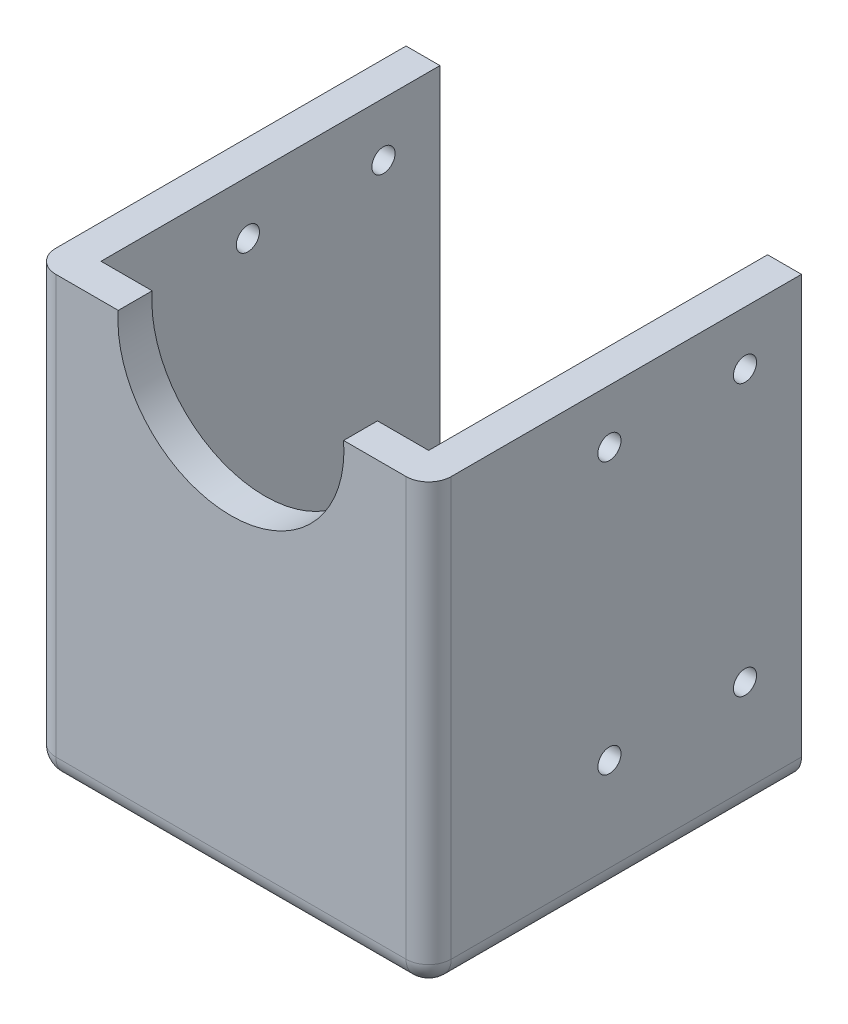
ISO-10303-21;
HEADER;
FILE_DESCRIPTION(('STEP AP214'),'2;1');
FILE_NAME('part.step','',(''),(''),'','','');
FILE_SCHEMA(('AUTOMOTIVE_DESIGN { 1 0 10303 214 1 1 1 1 }'));
ENDSEC;
DATA;
#1=APPLICATION_CONTEXT('core data for automotive mechanical design processes');
#2=APPLICATION_PROTOCOL_DEFINITION('international standard','automotive_design',2000,#1);
#3=PRODUCT_CONTEXT('',#1,'mechanical');
#4=PRODUCT('Part','Part','',(#3));
#5=PRODUCT_RELATED_PRODUCT_CATEGORY('part','',(#4));
#6=PRODUCT_DEFINITION_FORMATION('','',#4);
#7=PRODUCT_DEFINITION_CONTEXT('part definition',#1,'design');
#8=PRODUCT_DEFINITION('design','',#6,#7);
#9=PRODUCT_DEFINITION_SHAPE('','',#8);
#10=(LENGTH_UNIT() NAMED_UNIT(*) SI_UNIT(.MILLI.,.METRE.));
#11=(NAMED_UNIT(*) PLANE_ANGLE_UNIT() SI_UNIT($,.RADIAN.));
#12=(NAMED_UNIT(*) SI_UNIT($,.STERADIAN.) SOLID_ANGLE_UNIT());
#13=UNCERTAINTY_MEASURE_WITH_UNIT(LENGTH_MEASURE(1.E-05),#10,'distance_accuracy_value','');
#14=(GEOMETRIC_REPRESENTATION_CONTEXT(3) GLOBAL_UNCERTAINTY_ASSIGNED_CONTEXT((#13)) GLOBAL_UNIT_ASSIGNED_CONTEXT((#10,
#11,#12)) REPRESENTATION_CONTEXT('',''));
#15=CARTESIAN_POINT('',(0.,0.,0.));
#16=DIRECTION('',(0.,0.,1.));
#17=DIRECTION('',(1.,0.,0.));
#18=AXIS2_PLACEMENT_3D('',#15,#16,#17);
#19=CARTESIAN_POINT('',(0.,0.750000000000668,3.));
#20=DIRECTION('',(0.,-1.,0.));
#21=DIRECTION('',(1.,0.,0.));
#22=AXIS2_PLACEMENT_3D('',#19,#20,#21);
#23=PLANE('',#22);
#24=DIRECTION('',(0.,0.,-1.));
#25=VECTOR('',#24,1.);
#26=CARTESIAN_POINT('',(-17.2499999999993,0.750000000000666,3.));
#27=LINE('',#26,#25);
#28=CARTESIAN_POINT('',(-17.2499999999993,0.750000000000666,1.));
#29=VERTEX_POINT('',#28);
#30=CARTESIAN_POINT('',(-17.2499999999993,0.750000000000666,-30.));
#31=VERTEX_POINT('',#30);
#32=EDGE_CURVE('E213',#29,#31,#27,.T.);
#33=ORIENTED_EDGE('',*,*,#32,.F.);
#34=CARTESIAN_POINT('',(-15.2499999999993,0.750000000000667,1.));
#35=DIRECTION('',(0.,-1.,0.));
#36=DIRECTION('',(1.,0.,0.));
#37=AXIS2_PLACEMENT_3D('',#34,#35,#36);
#38=CIRCLE('',#37,2.);
#39=CARTESIAN_POINT('',(-15.2499999999993,0.750000000000667,3.));
#40=VERTEX_POINT('',#39);
#41=EDGE_CURVE('E216',#29,#40,#38,.F.);
#42=ORIENTED_EDGE('',*,*,#41,.T.);
#43=DIRECTION('',(-1.,0.,0.));
#44=VECTOR('',#43,1.);
#45=CARTESIAN_POINT('',(0.,0.750000000000668,3.));
#46=LINE('',#45,#44);
#47=CARTESIAN_POINT('',(-9.72183533758884,0.750000000000667,3.));
#48=VERTEX_POINT('',#47);
#49=EDGE_CURVE('E333',#48,#40,#46,.T.);
#50=ORIENTED_EDGE('',*,*,#49,.F.);
#51=DIRECTION('',(0.,0.,-1.));
#52=VECTOR('',#51,1.);
#53=CARTESIAN_POINT('',(-9.72183533758884,0.750000000000667,3.));
#54=LINE('',#53,#52);
#55=CARTESIAN_POINT('',(-9.72183533758884,0.750000000000667,0.));
#56=VERTEX_POINT('',#55);
#57=EDGE_CURVE('E351',#48,#56,#54,.T.);
#58=ORIENTED_EDGE('',*,*,#57,.T.);
#59=DIRECTION('',(-1.,0.,0.));
#60=VECTOR('',#59,1.);
#61=CARTESIAN_POINT('',(0.,0.750000000000668,0.));
#62=LINE('',#61,#60);
#63=CARTESIAN_POINT('',(-14.2499999999993,0.750000000000667,0.));
#64=VERTEX_POINT('',#63);
#65=EDGE_CURVE('E141',#56,#64,#62,.T.);
#66=ORIENTED_EDGE('',*,*,#65,.T.);
#67=DIRECTION('',(0.,0.,1.));
#68=VECTOR('',#67,1.);
#69=CARTESIAN_POINT('',(-14.2499999999993,0.750000000000667,-30.));
#70=LINE('',#69,#68);
#71=CARTESIAN_POINT('',(-14.2499999999993,0.750000000000667,-30.));
#72=VERTEX_POINT('',#71);
#73=EDGE_CURVE('E136',#72,#64,#70,.T.);
#74=ORIENTED_EDGE('',*,*,#73,.F.);
#75=DIRECTION('',(-1.,0.,0.));
#76=VECTOR('',#75,1.);
#77=CARTESIAN_POINT('',(0.,0.750000000000668,-30.));
#78=LINE('',#77,#76);
#79=EDGE_CURVE('E139',#72,#31,#78,.T.);
#80=ORIENTED_EDGE('',*,*,#79,.T.);
#81=EDGE_LOOP('',(#33,#42,#50,#58,#66,#74,#80));
#82=FACE_BOUND('',#81,.T.);
#83=ADVANCED_FACE('F34',(#82),#23,.F.);
#84=CARTESIAN_POINT('',(-17.2499999999993,0.,3.));
#85=DIRECTION('',(-1.,0.,0.));
#86=DIRECTION('',(0.,0.,1.));
#87=AXIS2_PLACEMENT_3D('',#84,#85,#86);
#88=PLANE('',#87);
#89=CARTESIAN_POINT('',(-17.2499999999993,-27.9999999999993,-13.));
#90=DIRECTION('',(-1.,0.,0.));
#91=DIRECTION('',(0.,0.,1.));
#92=AXIS2_PLACEMENT_3D('',#89,#90,#91);
#93=CIRCLE('',#92,1.025);
#94=CARTESIAN_POINT('',(-17.2499999999993,-27.9999999999993,-11.975));
#95=VERTEX_POINT('',#94);
#96=EDGE_CURVE('E285',#95,#95,#93,.T.);
#97=ORIENTED_EDGE('',*,*,#96,.F.);
#98=EDGE_LOOP('',(#97));
#99=FACE_BOUND('',#98,.T.);
#100=CARTESIAN_POINT('',(-17.2499999999993,-27.9999999999993,-25.));
#101=DIRECTION('',(-1.,0.,0.));
#102=DIRECTION('',(0.,0.,1.));
#103=AXIS2_PLACEMENT_3D('',#100,#101,#102);
#104=CIRCLE('',#103,1.025);
#105=CARTESIAN_POINT('',(-17.2499999999993,-27.9999999999993,-23.975));
#106=VERTEX_POINT('',#105);
#107=EDGE_CURVE('E292',#106,#106,#104,.T.);
#108=ORIENTED_EDGE('',*,*,#107,.F.);
#109=EDGE_LOOP('',(#108));
#110=FACE_BOUND('',#109,.T.);
#111=CARTESIAN_POINT('',(-17.2499999999993,-3.99999999999933,-13.));
#112=DIRECTION('',(-1.,0.,0.));
#113=DIRECTION('',(0.,0.,1.));
#114=AXIS2_PLACEMENT_3D('',#111,#112,#113);
#115=CIRCLE('',#114,1.025);
#116=CARTESIAN_POINT('',(-17.2499999999993,-3.99999999999933,-11.975));
#117=VERTEX_POINT('',#116);
#118=EDGE_CURVE('E299',#117,#117,#115,.T.);
#119=ORIENTED_EDGE('',*,*,#118,.F.);
#120=EDGE_LOOP('',(#119));
#121=FACE_BOUND('',#120,.T.);
#122=CARTESIAN_POINT('',(-17.2499999999993,-3.99999999999933,-25.));
#123=DIRECTION('',(-1.,0.,0.));
#124=DIRECTION('',(0.,0.,1.));
#125=AXIS2_PLACEMENT_3D('',#122,#123,#124);
#126=CIRCLE('',#125,1.025);
#127=CARTESIAN_POINT('',(-17.2499999999993,-3.99999999999933,-23.975));
#128=VERTEX_POINT('',#127);
#129=EDGE_CURVE('E168',#128,#128,#126,.T.);
#130=ORIENTED_EDGE('',*,*,#129,.F.);
#131=EDGE_LOOP('',(#130));
#132=FACE_BOUND('',#131,.T.);
#133=DIRECTION('',(0.,0.,-1.));
#134=VECTOR('',#133,1.);
#135=CARTESIAN_POINT('',(-17.2499999999993,-36.2499999999993,3.));
#136=LINE('',#135,#134);
#137=CARTESIAN_POINT('',(-17.2499999999993,-36.2499999999993,-30.));
#138=VERTEX_POINT('',#137);
#139=CARTESIAN_POINT('',(-17.2499999999993,-36.2499999999993,1.));
#140=VERTEX_POINT('',#139);
#141=EDGE_CURVE('E210',#138,#140,#136,.F.);
#142=ORIENTED_EDGE('',*,*,#141,.T.);
#143=DIRECTION('',(0.,1.,0.));
#144=VECTOR('',#143,1.);
#145=CARTESIAN_POINT('',(-17.2499999999993,0.,1.));
#146=LINE('',#145,#144);
#147=EDGE_CURVE('E212',#140,#29,#146,.T.);
#148=ORIENTED_EDGE('',*,*,#147,.T.);
#149=ORIENTED_EDGE('',*,*,#32,.T.);
#150=DIRECTION('',(0.,1.,0.));
#151=VECTOR('',#150,1.);
#152=CARTESIAN_POINT('',(-17.2499999999993,0.,-30.));
#153=LINE('',#152,#151);
#154=EDGE_CURVE('E156',#138,#31,#153,.T.);
#155=ORIENTED_EDGE('',*,*,#154,.F.);
#156=EDGE_LOOP('',(#142,#148,#149,#155));
#157=FACE_BOUND('',#156,.T.);
#158=ADVANCED_FACE('F311',(#99,#110,#121,#132,#157),#88,.T.);
#159=CARTESIAN_POINT('',(0.,-38.2499999999993,3.));
#160=DIRECTION('',(0.,-1.,0.));
#161=DIRECTION('',(1.,0.,0.));
#162=AXIS2_PLACEMENT_3D('',#159,#160,#161);
#163=PLANE('',#162);
#164=CARTESIAN_POINT('',(8.25000000000068,-38.2499999999993,-13.));
#165=DIRECTION('',(0.,-1.,0.));
#166=DIRECTION('',(1.,0.,0.));
#167=AXIS2_PLACEMENT_3D('',#164,#165,#166);
#168=CIRCLE('',#167,1.025);
#169=CARTESIAN_POINT('',(9.27500000000068,-38.2499999999993,-13.));
#170=VERTEX_POINT('',#169);
#171=EDGE_CURVE('E253',#170,#170,#168,.T.);
#172=ORIENTED_EDGE('',*,*,#171,.F.);
#173=EDGE_LOOP('',(#172));
#174=FACE_BOUND('',#173,.T.);
#175=CARTESIAN_POINT('',(-7.74999999999932,-38.2499999999993,-13.));
#176=DIRECTION('',(0.,-1.,0.));
#177=DIRECTION('',(1.,0.,0.));
#178=AXIS2_PLACEMENT_3D('',#175,#176,#177);
#179=CIRCLE('',#178,1.025);
#180=CARTESIAN_POINT('',(-6.72499999999932,-38.2499999999993,-13.));
#181=VERTEX_POINT('',#180);
#182=EDGE_CURVE('E261',#181,#181,#179,.T.);
#183=ORIENTED_EDGE('',*,*,#182,.F.);
#184=EDGE_LOOP('',(#183));
#185=FACE_BOUND('',#184,.T.);
#186=CARTESIAN_POINT('',(-7.74999999999932,-38.2499999999993,-25.));
#187=DIRECTION('',(0.,-1.,0.));
#188=DIRECTION('',(1.,0.,0.));
#189=AXIS2_PLACEMENT_3D('',#186,#187,#188);
#190=CIRCLE('',#189,1.025);
#191=CARTESIAN_POINT('',(-6.72499999999932,-38.2499999999993,-25.));
#192=VERTEX_POINT('',#191);
#193=EDGE_CURVE('E267',#192,#192,#190,.T.);
#194=ORIENTED_EDGE('',*,*,#193,.F.);
#195=EDGE_LOOP('',(#194));
#196=FACE_BOUND('',#195,.T.);
#197=CARTESIAN_POINT('',(8.25000000000068,-38.2499999999993,-25.));
#198=DIRECTION('',(0.,-1.,0.));
#199=DIRECTION('',(1.,0.,0.));
#200=AXIS2_PLACEMENT_3D('',#197,#198,#199);
#201=CIRCLE('',#200,1.025);
#202=CARTESIAN_POINT('',(9.27500000000068,-38.2499999999993,-25.));
#203=VERTEX_POINT('',#202);
#204=EDGE_CURVE('E273',#203,#203,#201,.T.);
#205=ORIENTED_EDGE('',*,*,#204,.F.);
#206=EDGE_LOOP('',(#205));
#207=FACE_BOUND('',#206,.T.);
#208=DIRECTION('',(-1.,0.,0.));
#209=VECTOR('',#208,1.);
#210=CARTESIAN_POINT('',(0.,-38.2499999999993,1.));
#211=LINE('',#210,#209);
#212=CARTESIAN_POINT('',(15.7500000000007,-38.2499999999993,1.));
#213=VERTEX_POINT('',#212);
#214=CARTESIAN_POINT('',(-15.2499999999993,-38.2499999999993,1.));
#215=VERTEX_POINT('',#214);
#216=EDGE_CURVE('E224',#213,#215,#211,.T.);
#217=ORIENTED_EDGE('',*,*,#216,.T.);
#218=DIRECTION('',(0.,0.,-1.));
#219=VECTOR('',#218,1.);
#220=CARTESIAN_POINT('',(-15.2499999999993,-38.2499999999993,3.));
#221=LINE('',#220,#219);
#222=CARTESIAN_POINT('',(-15.2499999999993,-38.2499999999993,-30.));
#223=VERTEX_POINT('',#222);
#224=EDGE_CURVE('E228',#215,#223,#221,.T.);
#225=ORIENTED_EDGE('',*,*,#224,.T.);
#226=DIRECTION('',(-1.,0.,0.));
#227=VECTOR('',#226,1.);
#228=CARTESIAN_POINT('',(0.,-38.2499999999993,-30.));
#229=LINE('',#228,#227);
#230=CARTESIAN_POINT('',(15.7500000000007,-38.2499999999993,-30.));
#231=VERTEX_POINT('',#230);
#232=EDGE_CURVE('E172',#231,#223,#229,.T.);
#233=ORIENTED_EDGE('',*,*,#232,.F.);
#234=DIRECTION('',(0.,0.,-1.));
#235=VECTOR('',#234,1.);
#236=CARTESIAN_POINT('',(15.7500000000007,-38.2499999999993,3.));
#237=LINE('',#236,#235);
#238=EDGE_CURVE('E226',#231,#213,#237,.F.);
#239=ORIENTED_EDGE('',*,*,#238,.T.);
#240=EDGE_LOOP('',(#217,#225,#233,#239));
#241=FACE_BOUND('',#240,.T.);
#242=ADVANCED_FACE('F314',(#174,#185,#196,#207,#241),#163,.T.);
#243=CARTESIAN_POINT('',(17.7500000000007,0.,3.));
#244=DIRECTION('',(-1.,0.,0.));
#245=DIRECTION('',(0.,0.,1.));
#246=AXIS2_PLACEMENT_3D('',#243,#244,#245);
#247=PLANE('',#246);
#248=CARTESIAN_POINT('',(17.7500000000007,-27.9999999999993,-13.));
#249=DIRECTION('',(1.,0.,0.));
#250=DIRECTION('',(0.,0.,-1.));
#251=AXIS2_PLACEMENT_3D('',#248,#249,#250);
#252=CIRCLE('',#251,1.025);
#253=CARTESIAN_POINT('',(17.7500000000007,-27.9999999999993,-14.025));
#254=VERTEX_POINT('',#253);
#255=EDGE_CURVE('E209',#254,#254,#252,.T.);
#256=ORIENTED_EDGE('',*,*,#255,.F.);
#257=EDGE_LOOP('',(#256));
#258=FACE_BOUND('',#257,.T.);
#259=CARTESIAN_POINT('',(17.7500000000007,-27.9999999999993,-25.));
#260=DIRECTION('',(1.,0.,0.));
#261=DIRECTION('',(0.,0.,-1.));
#262=AXIS2_PLACEMENT_3D('',#259,#260,#261);
#263=CIRCLE('',#262,1.025);
#264=CARTESIAN_POINT('',(17.7500000000007,-27.9999999999993,-26.025));
#265=VERTEX_POINT('',#264);
#266=EDGE_CURVE('E204',#265,#265,#263,.T.);
#267=ORIENTED_EDGE('',*,*,#266,.F.);
#268=EDGE_LOOP('',(#267));
#269=FACE_BOUND('',#268,.T.);
#270=CARTESIAN_POINT('',(17.7500000000007,-3.99999999999933,-13.));
#271=DIRECTION('',(1.,0.,0.));
#272=DIRECTION('',(0.,0.,-1.));
#273=AXIS2_PLACEMENT_3D('',#270,#271,#272);
#274=CIRCLE('',#273,1.025);
#275=CARTESIAN_POINT('',(17.7500000000007,-3.99999999999933,-14.025));
#276=VERTEX_POINT('',#275);
#277=EDGE_CURVE('E199',#276,#276,#274,.T.);
#278=ORIENTED_EDGE('',*,*,#277,.F.);
#279=EDGE_LOOP('',(#278));
#280=FACE_BOUND('',#279,.T.);
#281=CARTESIAN_POINT('',(17.7500000000007,-3.99999999999933,-25.));
#282=DIRECTION('',(1.,0.,0.));
#283=DIRECTION('',(0.,0.,-1.));
#284=AXIS2_PLACEMENT_3D('',#281,#282,#283);
#285=CIRCLE('',#284,1.025);
#286=CARTESIAN_POINT('',(17.7500000000007,-3.99999999999933,-26.025));
#287=VERTEX_POINT('',#286);
#288=EDGE_CURVE('E194',#287,#287,#285,.T.);
#289=ORIENTED_EDGE('',*,*,#288,.F.);
#290=EDGE_LOOP('',(#289));
#291=FACE_BOUND('',#290,.T.);
#292=DIRECTION('',(0.,1.,0.));
#293=VECTOR('',#292,1.);
#294=CARTESIAN_POINT('',(17.7500000000007,-38.2499999999993,1.));
#295=LINE('',#294,#293);
#296=CARTESIAN_POINT('',(17.7500000000007,0.75000000000067,1.));
#297=VERTEX_POINT('',#296);
#298=CARTESIAN_POINT('',(17.7500000000007,-36.2499999999993,1.));
#299=VERTEX_POINT('',#298);
#300=EDGE_CURVE('E51',#297,#299,#295,.F.);
#301=ORIENTED_EDGE('',*,*,#300,.T.);
#302=DIRECTION('',(0.,0.,-1.));
#303=VECTOR('',#302,1.);
#304=CARTESIAN_POINT('',(17.7500000000007,-36.2499999999993,-30.));
#305=LINE('',#304,#303);
#306=CARTESIAN_POINT('',(17.7500000000007,-36.2499999999993,-30.));
#307=VERTEX_POINT('',#306);
#308=EDGE_CURVE('E43',#299,#307,#305,.T.);
#309=ORIENTED_EDGE('',*,*,#308,.T.);
#310=DIRECTION('',(0.,1.,0.));
#311=VECTOR('',#310,1.);
#312=CARTESIAN_POINT('',(17.7500000000007,0.,-30.));
#313=LINE('',#312,#311);
#314=CARTESIAN_POINT('',(17.7500000000007,0.75000000000067,-30.));
#315=VERTEX_POINT('',#314);
#316=EDGE_CURVE('E174',#307,#315,#313,.T.);
#317=ORIENTED_EDGE('',*,*,#316,.T.);
#318=DIRECTION('',(0.,0.,-1.));
#319=VECTOR('',#318,1.);
#320=CARTESIAN_POINT('',(17.7500000000007,0.75000000000067,3.));
#321=LINE('',#320,#319);
#322=EDGE_CURVE('E379',#297,#315,#321,.T.);
#323=ORIENTED_EDGE('',*,*,#322,.F.);
#324=EDGE_LOOP('',(#301,#309,#317,#323));
#325=FACE_BOUND('',#324,.T.);
#326=ADVANCED_FACE('F595',(#258,#269,#280,#291,#325),#247,.F.);
#327=CARTESIAN_POINT('',(0.,0.750000000000668,3.));
#328=DIRECTION('',(0.,-1.,0.));
#329=DIRECTION('',(1.,0.,0.));
#330=AXIS2_PLACEMENT_3D('',#327,#328,#329);
#331=PLANE('',#330);
#332=DIRECTION('',(-1.,0.,0.));
#333=VECTOR('',#332,1.);
#334=CARTESIAN_POINT('',(0.,0.750000000000668,3.));
#335=LINE('',#334,#333);
#336=CARTESIAN_POINT('',(15.7500000000007,0.750000000000671,3.));
#337=VERTEX_POINT('',#336);
#338=CARTESIAN_POINT('',(10.2218353375902,0.75000000000067,3.));
#339=VERTEX_POINT('',#338);
#340=EDGE_CURVE('E340',#337,#339,#335,.T.);
#341=ORIENTED_EDGE('',*,*,#340,.F.);
#342=CARTESIAN_POINT('',(15.7500000000007,0.750000000000671,1.));
#343=DIRECTION('',(0.,-1.,0.));
#344=DIRECTION('',(1.,0.,0.));
#345=AXIS2_PLACEMENT_3D('',#342,#343,#344);
#346=CIRCLE('',#345,2.);
#347=EDGE_CURVE('E11',#337,#297,#346,.F.);
#348=ORIENTED_EDGE('',*,*,#347,.T.);
#349=ORIENTED_EDGE('',*,*,#322,.T.);
#350=DIRECTION('',(1.,0.,0.));
#351=VECTOR('',#350,1.);
#352=CARTESIAN_POINT('',(0.,0.750000000000672,-30.));
#353=LINE('',#352,#351);
#354=CARTESIAN_POINT('',(14.7500000000007,0.75000000000067,-30.));
#355=VERTEX_POINT('',#354);
#356=EDGE_CURVE('E177',#355,#315,#353,.T.);
#357=ORIENTED_EDGE('',*,*,#356,.F.);
#358=DIRECTION('',(0.,0.,1.));
#359=VECTOR('',#358,1.);
#360=CARTESIAN_POINT('',(14.7500000000007,0.75000000000067,-30.));
#361=LINE('',#360,#359);
#362=CARTESIAN_POINT('',(14.7500000000007,0.75000000000067,0.));
#363=VERTEX_POINT('',#362);
#364=EDGE_CURVE('E145',#355,#363,#361,.T.);
#365=ORIENTED_EDGE('',*,*,#364,.T.);
#366=DIRECTION('',(-1.,0.,0.));
#367=VECTOR('',#366,1.);
#368=CARTESIAN_POINT('',(0.,0.750000000000668,0.));
#369=LINE('',#368,#367);
#370=CARTESIAN_POINT('',(10.2218353375902,0.75000000000067,0.));
#371=VERTEX_POINT('',#370);
#372=EDGE_CURVE('E345',#363,#371,#369,.T.);
#373=ORIENTED_EDGE('',*,*,#372,.T.);
#374=DIRECTION('',(0.,0.,-1.));
#375=VECTOR('',#374,1.);
#376=CARTESIAN_POINT('',(10.2218353375902,0.75000000000067,3.));
#377=LINE('',#376,#375);
#378=EDGE_CURVE('E673',#339,#371,#377,.T.);
#379=ORIENTED_EDGE('',*,*,#378,.F.);
#380=EDGE_LOOP('',(#341,#348,#349,#357,#365,#373,#379));
#381=FACE_BOUND('',#380,.T.);
#382=ADVANCED_FACE('F378',(#381),#331,.F.);
#383=CARTESIAN_POINT('',(0.250000000000675,0.,3.));
#384=DIRECTION('',(0.,0.,-1.));
#385=DIRECTION('',(-1.,0.,0.));
#386=AXIS2_PLACEMENT_3D('',#383,#384,#385);
#387=CYLINDRICAL_SURFACE('',#386,10.);
#388=CARTESIAN_POINT('',(0.250000000000675,0.,0.));
#389=DIRECTION('',(0.,0.,1.));
#390=DIRECTION('',(1.,0.,0.));
#391=AXIS2_PLACEMENT_3D('',#388,#389,#390);
#392=CIRCLE('',#391,10.);
#393=EDGE_CURVE('E341',#56,#371,#392,.T.);
#394=ORIENTED_EDGE('',*,*,#393,.F.);
#395=ORIENTED_EDGE('',*,*,#57,.F.);
#396=CARTESIAN_POINT('',(0.250000000000675,0.,3.));
#397=DIRECTION('',(0.,0.,1.));
#398=DIRECTION('',(1.,0.,0.));
#399=AXIS2_PLACEMENT_3D('',#396,#397,#398);
#400=CIRCLE('',#399,10.);
#401=EDGE_CURVE('E339',#48,#339,#400,.T.);
#402=ORIENTED_EDGE('',*,*,#401,.T.);
#403=ORIENTED_EDGE('',*,*,#378,.T.);
#404=EDGE_LOOP('',(#394,#395,#402,#403));
#405=FACE_BOUND('',#404,.T.);
#406=ADVANCED_FACE('F594',(#405),#387,.F.);
#407=CARTESIAN_POINT('',(0.,0.,3.));
#408=DIRECTION('',(0.,0.,1.));
#409=DIRECTION('',(1.,0.,0.));
#410=AXIS2_PLACEMENT_3D('',#407,#408,#409);
#411=PLANE('',#410);
#412=ORIENTED_EDGE('',*,*,#49,.T.);
#413=DIRECTION('',(0.,1.,0.));
#414=VECTOR('',#413,1.);
#415=CARTESIAN_POINT('',(-15.2499999999993,0.,3.));
#416=LINE('',#415,#414);
#417=CARTESIAN_POINT('',(-15.2499999999993,-36.2499999999993,3.));
#418=VERTEX_POINT('',#417);
#419=EDGE_CURVE('E222',#40,#418,#416,.F.);
#420=ORIENTED_EDGE('',*,*,#419,.T.);
#421=DIRECTION('',(-1.,0.,0.));
#422=VECTOR('',#421,1.);
#423=CARTESIAN_POINT('',(0.,-36.2499999999993,3.));
#424=LINE('',#423,#422);
#425=CARTESIAN_POINT('',(15.7500000000007,-36.2499999999993,3.));
#426=VERTEX_POINT('',#425);
#427=EDGE_CURVE('E220',#418,#426,#424,.F.);
#428=ORIENTED_EDGE('',*,*,#427,.T.);
#429=DIRECTION('',(0.,1.,0.));
#430=VECTOR('',#429,1.);
#431=CARTESIAN_POINT('',(15.7500000000007,0.75000000000067,3.));
#432=LINE('',#431,#430);
#433=EDGE_CURVE('E218',#426,#337,#432,.T.);
#434=ORIENTED_EDGE('',*,*,#433,.T.);
#435=ORIENTED_EDGE('',*,*,#340,.T.);
#436=ORIENTED_EDGE('',*,*,#401,.F.);
#437=EDGE_LOOP('',(#412,#420,#428,#434,#435,#436));
#438=FACE_BOUND('',#437,.T.);
#439=ADVANCED_FACE('F336',(#438),#411,.T.);
#440=CARTESIAN_POINT('',(0.,0.,0.));
#441=DIRECTION('',(0.,0.,1.));
#442=DIRECTION('',(1.,0.,0.));
#443=AXIS2_PLACEMENT_3D('',#440,#441,#442);
#444=PLANE('',#443);
#445=DIRECTION('',(-1.,0.,0.));
#446=VECTOR('',#445,1.);
#447=CARTESIAN_POINT('',(0.,-35.2499999999993,0.));
#448=LINE('',#447,#446);
#449=CARTESIAN_POINT('',(14.7500000000007,-35.2499999999993,0.));
#450=VERTEX_POINT('',#449);
#451=CARTESIAN_POINT('',(-14.2499999999993,-35.2499999999993,0.));
#452=VERTEX_POINT('',#451);
#453=EDGE_CURVE('E162',#450,#452,#448,.T.);
#454=ORIENTED_EDGE('',*,*,#453,.T.);
#455=DIRECTION('',(0.,1.,0.));
#456=VECTOR('',#455,1.);
#457=CARTESIAN_POINT('',(-14.2499999999993,0.,0.));
#458=LINE('',#457,#456);
#459=EDGE_CURVE('E186',#452,#64,#458,.T.);
#460=ORIENTED_EDGE('',*,*,#459,.T.);
#461=ORIENTED_EDGE('',*,*,#65,.F.);
#462=ORIENTED_EDGE('',*,*,#393,.T.);
#463=ORIENTED_EDGE('',*,*,#372,.F.);
#464=DIRECTION('',(0.,1.,0.));
#465=VECTOR('',#464,1.);
#466=CARTESIAN_POINT('',(14.7500000000007,0.,0.));
#467=LINE('',#466,#465);
#468=EDGE_CURVE('E165',#450,#363,#467,.T.);
#469=ORIENTED_EDGE('',*,*,#468,.F.);
#470=EDGE_LOOP('',(#454,#460,#461,#462,#463,#469));
#471=FACE_BOUND('',#470,.T.);
#472=ADVANCED_FACE('F376',(#471),#444,.F.);
#473=CARTESIAN_POINT('',(-14.2499999999993,0.,-30.));
#474=DIRECTION('',(1.,0.,0.));
#475=DIRECTION('',(0.,0.,-1.));
#476=AXIS2_PLACEMENT_3D('',#473,#474,#475);
#477=PLANE('',#476);
#478=CARTESIAN_POINT('',(-14.2499999999993,-27.9999999999993,-13.));
#479=DIRECTION('',(1.,0.,0.));
#480=DIRECTION('',(0.,0.,-1.));
#481=AXIS2_PLACEMENT_3D('',#478,#479,#480);
#482=CIRCLE('',#481,1.025);
#483=CARTESIAN_POINT('',(-14.2499999999993,-27.9999999999993,-14.025));
#484=VERTEX_POINT('',#483);
#485=EDGE_CURVE('E208',#484,#484,#482,.T.);
#486=ORIENTED_EDGE('',*,*,#485,.F.);
#487=EDGE_LOOP('',(#486));
#488=FACE_BOUND('',#487,.T.);
#489=CARTESIAN_POINT('',(-14.2499999999993,-27.9999999999993,-25.));
#490=DIRECTION('',(1.,0.,0.));
#491=DIRECTION('',(0.,0.,-1.));
#492=AXIS2_PLACEMENT_3D('',#489,#490,#491);
#493=CIRCLE('',#492,1.025);
#494=CARTESIAN_POINT('',(-14.2499999999993,-27.9999999999993,-26.025));
#495=VERTEX_POINT('',#494);
#496=EDGE_CURVE('E203',#495,#495,#493,.T.);
#497=ORIENTED_EDGE('',*,*,#496,.F.);
#498=EDGE_LOOP('',(#497));
#499=FACE_BOUND('',#498,.T.);
#500=CARTESIAN_POINT('',(-14.2499999999993,-3.99999999999933,-13.));
#501=DIRECTION('',(1.,0.,0.));
#502=DIRECTION('',(0.,0.,-1.));
#503=AXIS2_PLACEMENT_3D('',#500,#501,#502);
#504=CIRCLE('',#503,1.025);
#505=CARTESIAN_POINT('',(-14.2499999999993,-3.99999999999933,-14.025));
#506=VERTEX_POINT('',#505);
#507=EDGE_CURVE('E198',#506,#506,#504,.T.);
#508=ORIENTED_EDGE('',*,*,#507,.F.);
#509=EDGE_LOOP('',(#508));
#510=FACE_BOUND('',#509,.T.);
#511=CARTESIAN_POINT('',(-14.2499999999993,-3.99999999999933,-25.));
#512=DIRECTION('',(1.,0.,0.));
#513=DIRECTION('',(0.,0.,-1.));
#514=AXIS2_PLACEMENT_3D('',#511,#512,#513);
#515=CIRCLE('',#514,1.025);
#516=CARTESIAN_POINT('',(-14.2499999999993,-3.99999999999933,-26.025));
#517=VERTEX_POINT('',#516);
#518=EDGE_CURVE('E193',#517,#517,#515,.T.);
#519=ORIENTED_EDGE('',*,*,#518,.F.);
#520=EDGE_LOOP('',(#519));
#521=FACE_BOUND('',#520,.T.);
#522=ORIENTED_EDGE('',*,*,#459,.F.);
#523=DIRECTION('',(0.,0.,1.));
#524=VECTOR('',#523,1.);
#525=CARTESIAN_POINT('',(-14.2499999999993,-35.2499999999993,-30.));
#526=LINE('',#525,#524);
#527=CARTESIAN_POINT('',(-14.2499999999993,-35.2499999999993,-30.));
#528=VERTEX_POINT('',#527);
#529=EDGE_CURVE('E161',#528,#452,#526,.T.);
#530=ORIENTED_EDGE('',*,*,#529,.F.);
#531=DIRECTION('',(0.,1.,0.));
#532=VECTOR('',#531,1.);
#533=CARTESIAN_POINT('',(-14.2499999999993,0.,-30.));
#534=LINE('',#533,#532);
#535=EDGE_CURVE('E153',#528,#72,#534,.T.);
#536=ORIENTED_EDGE('',*,*,#535,.T.);
#537=ORIENTED_EDGE('',*,*,#73,.T.);
#538=EDGE_LOOP('',(#522,#530,#536,#537));
#539=FACE_BOUND('',#538,.T.);
#540=ADVANCED_FACE('F159',(#488,#499,#510,#521,#539),#477,.T.);
#541=CARTESIAN_POINT('',(0.,-35.2499999999993,-30.));
#542=DIRECTION('',(0.,1.,0.));
#543=DIRECTION('',(-1.,0.,0.));
#544=AXIS2_PLACEMENT_3D('',#541,#542,#543);
#545=PLANE('',#544);
#546=CARTESIAN_POINT('',(8.25000000000068,-35.2499999999993,-13.));
#547=DIRECTION('',(0.,-1.,0.));
#548=DIRECTION('',(1.,0.,0.));
#549=AXIS2_PLACEMENT_3D('',#546,#547,#548);
#550=CIRCLE('',#549,1.025);
#551=CARTESIAN_POINT('',(9.27500000000068,-35.2499999999993,-13.));
#552=VERTEX_POINT('',#551);
#553=EDGE_CURVE('E256',#552,#552,#550,.T.);
#554=ORIENTED_EDGE('',*,*,#553,.T.);
#555=EDGE_LOOP('',(#554));
#556=FACE_BOUND('',#555,.T.);
#557=CARTESIAN_POINT('',(-7.74999999999932,-35.2499999999993,-13.));
#558=DIRECTION('',(0.,-1.,0.));
#559=DIRECTION('',(1.,0.,0.));
#560=AXIS2_PLACEMENT_3D('',#557,#558,#559);
#561=CIRCLE('',#560,1.025);
#562=CARTESIAN_POINT('',(-6.72499999999932,-35.2499999999993,-13.));
#563=VERTEX_POINT('',#562);
#564=EDGE_CURVE('E264',#563,#563,#561,.T.);
#565=ORIENTED_EDGE('',*,*,#564,.T.);
#566=EDGE_LOOP('',(#565));
#567=FACE_BOUND('',#566,.T.);
#568=CARTESIAN_POINT('',(-7.74999999999932,-35.2499999999993,-25.));
#569=DIRECTION('',(0.,-1.,0.));
#570=DIRECTION('',(1.,0.,0.));
#571=AXIS2_PLACEMENT_3D('',#568,#569,#570);
#572=CIRCLE('',#571,1.025);
#573=CARTESIAN_POINT('',(-6.72499999999932,-35.2499999999993,-25.));
#574=VERTEX_POINT('',#573);
#575=EDGE_CURVE('E270',#574,#574,#572,.T.);
#576=ORIENTED_EDGE('',*,*,#575,.T.);
#577=EDGE_LOOP('',(#576));
#578=FACE_BOUND('',#577,.T.);
#579=CARTESIAN_POINT('',(8.25000000000068,-35.2499999999993,-25.));
#580=DIRECTION('',(0.,-1.,0.));
#581=DIRECTION('',(1.,0.,0.));
#582=AXIS2_PLACEMENT_3D('',#579,#580,#581);
#583=CIRCLE('',#582,1.025);
#584=CARTESIAN_POINT('',(9.27500000000068,-35.2499999999993,-25.));
#585=VERTEX_POINT('',#584);
#586=EDGE_CURVE('E276',#585,#585,#583,.T.);
#587=ORIENTED_EDGE('',*,*,#586,.T.);
#588=EDGE_LOOP('',(#587));
#589=FACE_BOUND('',#588,.T.);
#590=ORIENTED_EDGE('',*,*,#453,.F.);
#591=DIRECTION('',(0.,0.,1.));
#592=VECTOR('',#591,1.);
#593=CARTESIAN_POINT('',(14.7500000000007,-35.2499999999993,-30.));
#594=LINE('',#593,#592);
#595=CARTESIAN_POINT('',(14.7500000000007,-35.2499999999993,-30.));
#596=VERTEX_POINT('',#595);
#597=EDGE_CURVE('E348',#596,#450,#594,.T.);
#598=ORIENTED_EDGE('',*,*,#597,.F.);
#599=DIRECTION('',(-1.,0.,0.));
#600=VECTOR('',#599,1.);
#601=CARTESIAN_POINT('',(0.,-35.2499999999993,-30.));
#602=LINE('',#601,#600);
#603=EDGE_CURVE('E146',#596,#528,#602,.T.);
#604=ORIENTED_EDGE('',*,*,#603,.T.);
#605=ORIENTED_EDGE('',*,*,#529,.T.);
#606=EDGE_LOOP('',(#590,#598,#604,#605));
#607=FACE_BOUND('',#606,.T.);
#608=ADVANCED_FACE('F373',(#556,#567,#578,#589,#607),#545,.T.);
#609=CARTESIAN_POINT('',(14.7500000000007,0.,-30.));
#610=DIRECTION('',(1.,0.,0.));
#611=DIRECTION('',(0.,0.,-1.));
#612=AXIS2_PLACEMENT_3D('',#609,#610,#611);
#613=PLANE('',#612);
#614=CARTESIAN_POINT('',(14.7500000000007,-27.9999999999993,-13.));
#615=DIRECTION('',(1.,0.,0.));
#616=DIRECTION('',(0.,0.,-1.));
#617=AXIS2_PLACEMENT_3D('',#614,#615,#616);
#618=CIRCLE('',#617,1.025);
#619=CARTESIAN_POINT('',(14.7500000000007,-27.9999999999993,-14.025));
#620=VERTEX_POINT('',#619);
#621=EDGE_CURVE('E205',#620,#620,#618,.T.);
#622=ORIENTED_EDGE('',*,*,#621,.T.);
#623=EDGE_LOOP('',(#622));
#624=FACE_BOUND('',#623,.T.);
#625=CARTESIAN_POINT('',(14.7500000000007,-27.9999999999993,-25.));
#626=DIRECTION('',(1.,0.,0.));
#627=DIRECTION('',(0.,0.,-1.));
#628=AXIS2_PLACEMENT_3D('',#625,#626,#627);
#629=CIRCLE('',#628,1.025);
#630=CARTESIAN_POINT('',(14.7500000000007,-27.9999999999993,-26.025));
#631=VERTEX_POINT('',#630);
#632=EDGE_CURVE('E200',#631,#631,#629,.T.);
#633=ORIENTED_EDGE('',*,*,#632,.T.);
#634=EDGE_LOOP('',(#633));
#635=FACE_BOUND('',#634,.T.);
#636=CARTESIAN_POINT('',(14.7500000000007,-3.99999999999933,-13.));
#637=DIRECTION('',(1.,0.,0.));
#638=DIRECTION('',(0.,0.,-1.));
#639=AXIS2_PLACEMENT_3D('',#636,#637,#638);
#640=CIRCLE('',#639,1.025);
#641=CARTESIAN_POINT('',(14.7500000000007,-3.99999999999933,-14.025));
#642=VERTEX_POINT('',#641);
#643=EDGE_CURVE('E195',#642,#642,#640,.T.);
#644=ORIENTED_EDGE('',*,*,#643,.T.);
#645=EDGE_LOOP('',(#644));
#646=FACE_BOUND('',#645,.T.);
#647=CARTESIAN_POINT('',(14.7500000000007,-3.99999999999933,-25.));
#648=DIRECTION('',(1.,0.,0.));
#649=DIRECTION('',(0.,0.,-1.));
#650=AXIS2_PLACEMENT_3D('',#647,#648,#649);
#651=CIRCLE('',#650,1.025);
#652=CARTESIAN_POINT('',(14.7500000000007,-3.99999999999933,-26.025));
#653=VERTEX_POINT('',#652);
#654=EDGE_CURVE('E190',#653,#653,#651,.T.);
#655=ORIENTED_EDGE('',*,*,#654,.T.);
#656=EDGE_LOOP('',(#655));
#657=FACE_BOUND('',#656,.T.);
#658=ORIENTED_EDGE('',*,*,#468,.T.);
#659=ORIENTED_EDGE('',*,*,#364,.F.);
#660=DIRECTION('',(0.,1.,0.));
#661=VECTOR('',#660,1.);
#662=CARTESIAN_POINT('',(14.7500000000007,0.,-30.));
#663=LINE('',#662,#661);
#664=EDGE_CURVE('E180',#596,#355,#663,.T.);
#665=ORIENTED_EDGE('',*,*,#664,.F.);
#666=ORIENTED_EDGE('',*,*,#597,.T.);
#667=EDGE_LOOP('',(#658,#659,#665,#666));
#668=FACE_BOUND('',#667,.T.);
#669=ADVANCED_FACE('F377',(#624,#635,#646,#657,#668),#613,.F.);
#670=CARTESIAN_POINT('',(0.,0.,-30.));
#671=DIRECTION('',(0.,0.,1.));
#672=DIRECTION('',(1.,0.,0.));
#673=AXIS2_PLACEMENT_3D('',#670,#671,#672);
#674=PLANE('',#673);
#675=ORIENTED_EDGE('',*,*,#232,.T.);
#676=CARTESIAN_POINT('',(-15.2499999999993,-36.2499999999993,-30.));
#677=DIRECTION('',(0.,0.,1.));
#678=DIRECTION('',(1.,0.,0.));
#679=AXIS2_PLACEMENT_3D('',#676,#677,#678);
#680=CIRCLE('',#679,2.);
#681=EDGE_CURVE('E232',#223,#138,#680,.F.);
#682=ORIENTED_EDGE('',*,*,#681,.T.);
#683=ORIENTED_EDGE('',*,*,#154,.T.);
#684=ORIENTED_EDGE('',*,*,#79,.F.);
#685=ORIENTED_EDGE('',*,*,#535,.F.);
#686=ORIENTED_EDGE('',*,*,#603,.F.);
#687=ORIENTED_EDGE('',*,*,#664,.T.);
#688=ORIENTED_EDGE('',*,*,#356,.T.);
#689=ORIENTED_EDGE('',*,*,#316,.F.);
#690=CARTESIAN_POINT('',(15.7500000000007,-36.2499999999993,-30.));
#691=DIRECTION('',(0.,0.,1.));
#692=DIRECTION('',(1.,0.,0.));
#693=AXIS2_PLACEMENT_3D('',#690,#691,#692);
#694=CIRCLE('',#693,2.);
#695=EDGE_CURVE('E230',#307,#231,#694,.F.);
#696=ORIENTED_EDGE('',*,*,#695,.T.);
#697=EDGE_LOOP('',(#675,#682,#683,#684,#685,#686,#687,#688,#689,#696));
#698=FACE_BOUND('',#697,.T.);
#699=ADVANCED_FACE('F151',(#698),#674,.F.);
#700=CARTESIAN_POINT('',(-25.2499999999993,-3.99999999999933,-25.));
#701=DIRECTION('',(1.,0.,0.));
#702=DIRECTION('',(0.,0.,-1.));
#703=AXIS2_PLACEMENT_3D('',#700,#701,#702);
#704=CYLINDRICAL_SURFACE('',#703,1.025);
#705=ORIENTED_EDGE('',*,*,#288,.T.);
#706=EDGE_LOOP('',(#705));
#707=FACE_BOUND('',#706,.T.);
#708=ORIENTED_EDGE('',*,*,#654,.F.);
#709=EDGE_LOOP('',(#708));
#710=FACE_BOUND('',#709,.T.);
#711=ADVANCED_FACE('F547',(#707,#710),#704,.F.);
#712=ORIENTED_EDGE('',*,*,#129,.T.);
#713=EDGE_LOOP('',(#712));
#714=FACE_BOUND('',#713,.T.);
#715=ORIENTED_EDGE('',*,*,#518,.T.);
#716=EDGE_LOOP('',(#715));
#717=FACE_BOUND('',#716,.T.);
#718=ADVANCED_FACE('F309',(#714,#717),#704,.F.);
#719=CARTESIAN_POINT('',(-25.2499999999993,-3.99999999999933,-13.));
#720=DIRECTION('',(1.,0.,0.));
#721=DIRECTION('',(0.,0.,-1.));
#722=AXIS2_PLACEMENT_3D('',#719,#720,#721);
#723=CYLINDRICAL_SURFACE('',#722,1.025);
#724=ORIENTED_EDGE('',*,*,#277,.T.);
#725=EDGE_LOOP('',(#724));
#726=FACE_BOUND('',#725,.T.);
#727=ORIENTED_EDGE('',*,*,#643,.F.);
#728=EDGE_LOOP('',(#727));
#729=FACE_BOUND('',#728,.T.);
#730=ADVANCED_FACE('F531',(#726,#729),#723,.F.);
#731=ORIENTED_EDGE('',*,*,#118,.T.);
#732=EDGE_LOOP('',(#731));
#733=FACE_BOUND('',#732,.T.);
#734=ORIENTED_EDGE('',*,*,#507,.T.);
#735=EDGE_LOOP('',(#734));
#736=FACE_BOUND('',#735,.T.);
#737=ADVANCED_FACE('F523',(#733,#736),#723,.F.);
#738=CARTESIAN_POINT('',(-25.2499999999993,-27.9999999999993,-25.));
#739=DIRECTION('',(1.,0.,0.));
#740=DIRECTION('',(0.,0.,-1.));
#741=AXIS2_PLACEMENT_3D('',#738,#739,#740);
#742=CYLINDRICAL_SURFACE('',#741,1.025);
#743=ORIENTED_EDGE('',*,*,#266,.T.);
#744=EDGE_LOOP('',(#743));
#745=FACE_BOUND('',#744,.T.);
#746=ORIENTED_EDGE('',*,*,#632,.F.);
#747=EDGE_LOOP('',(#746));
#748=FACE_BOUND('',#747,.T.);
#749=ADVANCED_FACE('F514',(#745,#748),#742,.F.);
#750=ORIENTED_EDGE('',*,*,#107,.T.);
#751=EDGE_LOOP('',(#750));
#752=FACE_BOUND('',#751,.T.);
#753=ORIENTED_EDGE('',*,*,#496,.T.);
#754=EDGE_LOOP('',(#753));
#755=FACE_BOUND('',#754,.T.);
#756=ADVANCED_FACE('F506',(#752,#755),#742,.F.);
#757=CARTESIAN_POINT('',(-25.2499999999993,-27.9999999999993,-13.));
#758=DIRECTION('',(1.,0.,0.));
#759=DIRECTION('',(0.,0.,-1.));
#760=AXIS2_PLACEMENT_3D('',#757,#758,#759);
#761=CYLINDRICAL_SURFACE('',#760,1.025);
#762=ORIENTED_EDGE('',*,*,#255,.T.);
#763=EDGE_LOOP('',(#762));
#764=FACE_BOUND('',#763,.T.);
#765=ORIENTED_EDGE('',*,*,#621,.F.);
#766=EDGE_LOOP('',(#765));
#767=FACE_BOUND('',#766,.T.);
#768=ADVANCED_FACE('F497',(#764,#767),#761,.F.);
#769=ORIENTED_EDGE('',*,*,#96,.T.);
#770=EDGE_LOOP('',(#769));
#771=FACE_BOUND('',#770,.T.);
#772=ORIENTED_EDGE('',*,*,#485,.T.);
#773=EDGE_LOOP('',(#772));
#774=FACE_BOUND('',#773,.T.);
#775=ADVANCED_FACE('F487',(#771,#774),#761,.F.);
#776=CARTESIAN_POINT('',(8.25000000000068,-35.2499999999993,-25.));
#777=DIRECTION('',(0.,-1.,0.));
#778=DIRECTION('',(1.,0.,0.));
#779=AXIS2_PLACEMENT_3D('',#776,#777,#778);
#780=CYLINDRICAL_SURFACE('',#779,1.025);
#781=ORIENTED_EDGE('',*,*,#586,.F.);
#782=EDGE_LOOP('',(#781));
#783=FACE_BOUND('',#782,.T.);
#784=ORIENTED_EDGE('',*,*,#204,.T.);
#785=EDGE_LOOP('',(#784));
#786=FACE_BOUND('',#785,.T.);
#787=ADVANCED_FACE('F478',(#783,#786),#780,.F.);
#788=CARTESIAN_POINT('',(-7.74999999999932,-35.2499999999993,-25.));
#789=DIRECTION('',(0.,-1.,0.));
#790=DIRECTION('',(1.,0.,0.));
#791=AXIS2_PLACEMENT_3D('',#788,#789,#790);
#792=CYLINDRICAL_SURFACE('',#791,1.025);
#793=ORIENTED_EDGE('',*,*,#575,.F.);
#794=EDGE_LOOP('',(#793));
#795=FACE_BOUND('',#794,.T.);
#796=ORIENTED_EDGE('',*,*,#193,.T.);
#797=EDGE_LOOP('',(#796));
#798=FACE_BOUND('',#797,.T.);
#799=ADVANCED_FACE('F469',(#795,#798),#792,.F.);
#800=CARTESIAN_POINT('',(-7.74999999999932,-35.2499999999993,-13.));
#801=DIRECTION('',(0.,-1.,0.));
#802=DIRECTION('',(1.,0.,0.));
#803=AXIS2_PLACEMENT_3D('',#800,#801,#802);
#804=CYLINDRICAL_SURFACE('',#803,1.025);
#805=ORIENTED_EDGE('',*,*,#564,.F.);
#806=EDGE_LOOP('',(#805));
#807=FACE_BOUND('',#806,.T.);
#808=ORIENTED_EDGE('',*,*,#182,.T.);
#809=EDGE_LOOP('',(#808));
#810=FACE_BOUND('',#809,.T.);
#811=ADVANCED_FACE('F399',(#807,#810),#804,.F.);
#812=CARTESIAN_POINT('',(8.25000000000068,-35.2499999999993,-13.));
#813=DIRECTION('',(0.,-1.,0.));
#814=DIRECTION('',(1.,0.,0.));
#815=AXIS2_PLACEMENT_3D('',#812,#813,#814);
#816=CYLINDRICAL_SURFACE('',#815,1.025);
#817=ORIENTED_EDGE('',*,*,#553,.F.);
#818=EDGE_LOOP('',(#817));
#819=FACE_BOUND('',#818,.T.);
#820=ORIENTED_EDGE('',*,*,#171,.T.);
#821=EDGE_LOOP('',(#820));
#822=FACE_BOUND('',#821,.T.);
#823=ADVANCED_FACE('F393',(#819,#822),#816,.F.);
#824=CARTESIAN_POINT('',(15.7500000000007,0.,1.));
#825=DIRECTION('',(0.,-1.,0.));
#826=DIRECTION('',(0.,0.,-1.));
#827=AXIS2_PLACEMENT_3D('',#824,#825,#826);
#828=CYLINDRICAL_SURFACE('',#827,2.);
#829=ORIENTED_EDGE('',*,*,#347,.F.);
#830=ORIENTED_EDGE('',*,*,#433,.F.);
#831=CARTESIAN_POINT('',(15.7500000000007,-36.2499999999993,1.));
#832=DIRECTION('',(0.,-1.,0.));
#833=DIRECTION('',(0.,0.,-1.));
#834=AXIS2_PLACEMENT_3D('',#831,#832,#833);
#835=CIRCLE('',#834,2.);
#836=EDGE_CURVE('E38',#299,#426,#835,.T.);
#837=ORIENTED_EDGE('',*,*,#836,.F.);
#838=ORIENTED_EDGE('',*,*,#300,.F.);
#839=EDGE_LOOP('',(#829,#830,#837,#838));
#840=FACE_BOUND('',#839,.T.);
#841=ADVANCED_FACE('F36',(#840),#828,.T.);
#842=CARTESIAN_POINT('',(15.7500000000007,-36.2499999999993,3.));
#843=DIRECTION('',(0.,0.,1.));
#844=DIRECTION('',(1.,0.,0.));
#845=AXIS2_PLACEMENT_3D('',#842,#843,#844);
#846=CYLINDRICAL_SURFACE('',#845,2.);
#847=ORIENTED_EDGE('',*,*,#695,.F.);
#848=ORIENTED_EDGE('',*,*,#308,.F.);
#849=CARTESIAN_POINT('',(15.7500000000007,-36.2499999999993,1.));
#850=DIRECTION('',(0.,0.,1.));
#851=DIRECTION('',(1.,0.,0.));
#852=AXIS2_PLACEMENT_3D('',#849,#850,#851);
#853=CIRCLE('',#852,2.);
#854=EDGE_CURVE('E247',#213,#299,#853,.T.);
#855=ORIENTED_EDGE('',*,*,#854,.F.);
#856=ORIENTED_EDGE('',*,*,#238,.F.);
#857=EDGE_LOOP('',(#847,#848,#855,#856));
#858=FACE_BOUND('',#857,.T.);
#859=ADVANCED_FACE('F385',(#858),#846,.T.);
#860=CARTESIAN_POINT('',(15.7500000000007,-36.2499999999993,1.));
#861=DIRECTION('',(0.,0.,1.));
#862=DIRECTION('',(1.,0.,0.));
#863=AXIS2_PLACEMENT_3D('',#860,#861,#862);
#864=SPHERICAL_SURFACE('',#863,2.);
#865=ORIENTED_EDGE('',*,*,#854,.T.);
#866=ORIENTED_EDGE('',*,*,#836,.T.);
#867=CARTESIAN_POINT('',(15.7500000000007,-36.2499999999993,1.));
#868=DIRECTION('',(1.,0.,0.));
#869=DIRECTION('',(0.,0.,-1.));
#870=AXIS2_PLACEMENT_3D('',#867,#868,#869);
#871=CIRCLE('',#870,2.);
#872=EDGE_CURVE('E245',#213,#426,#871,.F.);
#873=ORIENTED_EDGE('',*,*,#872,.F.);
#874=EDGE_LOOP('',(#865,#866,#873));
#875=FACE_BOUND('',#874,.T.);
#876=ADVANCED_FACE('F398',(#875),#864,.T.);
#877=CARTESIAN_POINT('',(0.,-36.2499999999993,1.));
#878=DIRECTION('',(-1.,0.,0.));
#879=DIRECTION('',(0.,-1.,0.));
#880=AXIS2_PLACEMENT_3D('',#877,#878,#879);
#881=CYLINDRICAL_SURFACE('',#880,2.);
#882=ORIENTED_EDGE('',*,*,#872,.T.);
#883=ORIENTED_EDGE('',*,*,#427,.F.);
#884=CARTESIAN_POINT('',(-15.2499999999993,-36.2499999999993,1.));
#885=DIRECTION('',(-1.,0.,0.));
#886=DIRECTION('',(0.,0.,1.));
#887=AXIS2_PLACEMENT_3D('',#884,#885,#886);
#888=CIRCLE('',#887,2.);
#889=EDGE_CURVE('E242',#215,#418,#888,.T.);
#890=ORIENTED_EDGE('',*,*,#889,.F.);
#891=ORIENTED_EDGE('',*,*,#216,.F.);
#892=EDGE_LOOP('',(#882,#883,#890,#891));
#893=FACE_BOUND('',#892,.T.);
#894=ADVANCED_FACE('F389',(#893),#881,.T.);
#895=CARTESIAN_POINT('',(-15.2499999999993,-36.2499999999993,3.));
#896=DIRECTION('',(0.,0.,-1.));
#897=DIRECTION('',(-1.,0.,0.));
#898=AXIS2_PLACEMENT_3D('',#895,#896,#897);
#899=CYLINDRICAL_SURFACE('',#898,2.);
#900=ORIENTED_EDGE('',*,*,#681,.F.);
#901=ORIENTED_EDGE('',*,*,#224,.F.);
#902=CARTESIAN_POINT('',(-15.2499999999993,-36.2499999999993,1.));
#903=DIRECTION('',(0.,0.,1.));
#904=DIRECTION('',(1.,0.,0.));
#905=AXIS2_PLACEMENT_3D('',#902,#903,#904);
#906=CIRCLE('',#905,2.);
#907=EDGE_CURVE('E239',#140,#215,#906,.T.);
#908=ORIENTED_EDGE('',*,*,#907,.F.);
#909=ORIENTED_EDGE('',*,*,#141,.F.);
#910=EDGE_LOOP('',(#900,#901,#908,#909));
#911=FACE_BOUND('',#910,.T.);
#912=ADVANCED_FACE('F324',(#911),#899,.T.);
#913=CARTESIAN_POINT('',(-15.2499999999993,-36.2499999999993,1.));
#914=DIRECTION('',(0.,0.,1.));
#915=DIRECTION('',(1.,0.,0.));
#916=AXIS2_PLACEMENT_3D('',#913,#914,#915);
#917=SPHERICAL_SURFACE('',#916,2.);
#918=ORIENTED_EDGE('',*,*,#907,.T.);
#919=ORIENTED_EDGE('',*,*,#889,.T.);
#920=CARTESIAN_POINT('',(-15.2499999999993,-36.2499999999993,1.));
#921=DIRECTION('',(0.,-1.,0.));
#922=DIRECTION('',(0.,0.,-1.));
#923=AXIS2_PLACEMENT_3D('',#920,#921,#922);
#924=CIRCLE('',#923,2.);
#925=EDGE_CURVE('E236',#140,#418,#924,.F.);
#926=ORIENTED_EDGE('',*,*,#925,.F.);
#927=EDGE_LOOP('',(#918,#919,#926));
#928=FACE_BOUND('',#927,.T.);
#929=ADVANCED_FACE('F327',(#928),#917,.T.);
#930=CARTESIAN_POINT('',(-15.2499999999993,0.,1.));
#931=DIRECTION('',(0.,1.,0.));
#932=DIRECTION('',(0.,0.,1.));
#933=AXIS2_PLACEMENT_3D('',#930,#931,#932);
#934=CYLINDRICAL_SURFACE('',#933,2.);
#935=ORIENTED_EDGE('',*,*,#925,.T.);
#936=ORIENTED_EDGE('',*,*,#419,.F.);
#937=ORIENTED_EDGE('',*,*,#41,.F.);
#938=ORIENTED_EDGE('',*,*,#147,.F.);
#939=EDGE_LOOP('',(#935,#936,#937,#938));
#940=FACE_BOUND('',#939,.T.);
#941=ADVANCED_FACE('F330',(#940),#934,.T.);
#942=CLOSED_SHELL('',(#83,#158,#242,#326,#382,#406,#439,#472,#540,#608,#669,#699,#711,#718,#730,
#737,#749,#756,#768,#775,#787,#799,#811,#823,#841,#859,#876,#894,#912,#929,#941));
#943=MANIFOLD_SOLID_BREP('B2',#942);
#944=ADVANCED_BREP_SHAPE_REPRESENTATION('',(#18,#943),#14);
#945=SHAPE_DEFINITION_REPRESENTATION(#9,#944);
ENDSEC;
END-ISO-10303-21;
